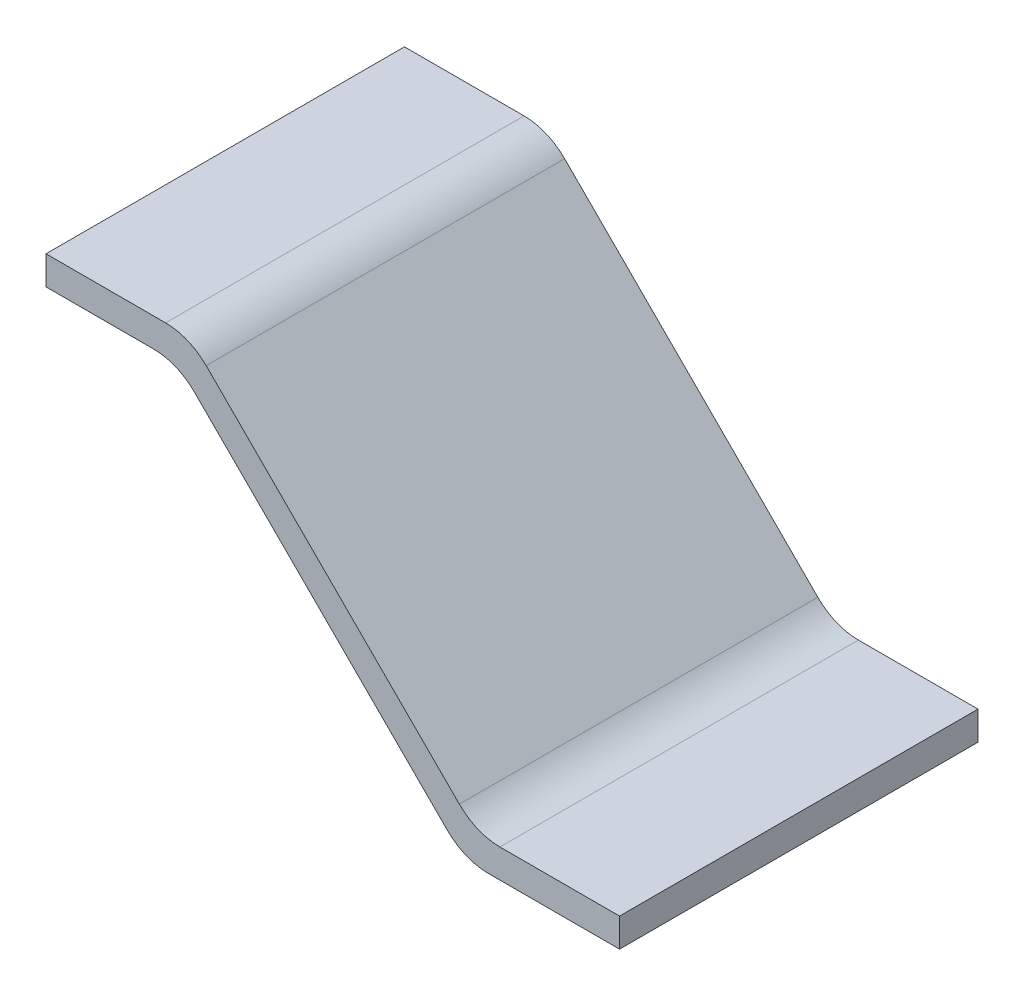
ISO-10303-21;
HEADER;
FILE_DESCRIPTION(('STEP AP214'),'2;1');
FILE_NAME('part.step','',(''),(''),'','','');
FILE_SCHEMA(('AUTOMOTIVE_DESIGN { 1 0 10303 214 1 1 1 1 }'));
ENDSEC;
DATA;
#1=APPLICATION_CONTEXT('core data for automotive mechanical design processes');
#2=APPLICATION_PROTOCOL_DEFINITION('international standard','automotive_design',2000,#1);
#3=PRODUCT_CONTEXT('',#1,'mechanical');
#4=PRODUCT('Part','Part','',(#3));
#5=PRODUCT_RELATED_PRODUCT_CATEGORY('part','',(#4));
#6=PRODUCT_DEFINITION_FORMATION('','',#4);
#7=PRODUCT_DEFINITION_CONTEXT('part definition',#1,'design');
#8=PRODUCT_DEFINITION('design','',#6,#7);
#9=PRODUCT_DEFINITION_SHAPE('','',#8);
#10=(LENGTH_UNIT() NAMED_UNIT(*) SI_UNIT(.MILLI.,.METRE.));
#11=(NAMED_UNIT(*) PLANE_ANGLE_UNIT() SI_UNIT($,.RADIAN.));
#12=(NAMED_UNIT(*) SI_UNIT($,.STERADIAN.) SOLID_ANGLE_UNIT());
#13=UNCERTAINTY_MEASURE_WITH_UNIT(LENGTH_MEASURE(1.E-05),#10,'distance_accuracy_value','');
#14=(GEOMETRIC_REPRESENTATION_CONTEXT(3) GLOBAL_UNCERTAINTY_ASSIGNED_CONTEXT((#13)) GLOBAL_UNIT_ASSIGNED_CONTEXT((#10,
#11,#12)) REPRESENTATION_CONTEXT('',''));
#15=CARTESIAN_POINT('',(0.,0.,0.));
#16=DIRECTION('',(0.,0.,1.));
#17=DIRECTION('',(1.,0.,0.));
#18=AXIS2_PLACEMENT_3D('',#15,#16,#17);
#19=CARTESIAN_POINT('',(0.,-0.1,0.625));
#20=DIRECTION('',(1.,0.,0.));
#21=DIRECTION('',(0.,0.,-1.));
#22=AXIS2_PLACEMENT_3D('',#19,#20,#21);
#23=PLANE('',#22);
#24=DIRECTION('',(0.,-1.,0.));
#25=VECTOR('',#24,1.);
#26=CARTESIAN_POINT('',(0.,-0.1,-0.625));
#27=LINE('',#26,#25);
#28=CARTESIAN_POINT('',(0.,0.,-0.625));
#29=VERTEX_POINT('',#28);
#30=CARTESIAN_POINT('',(0.,-0.1,-0.625));
#31=VERTEX_POINT('',#30);
#32=EDGE_CURVE('E145',#29,#31,#27,.T.);
#33=ORIENTED_EDGE('',*,*,#32,.T.);
#34=DIRECTION('',(0.,0.,-1.));
#35=VECTOR('',#34,1.);
#36=CARTESIAN_POINT('',(0.,-0.1,0.625));
#37=LINE('',#36,#35);
#38=CARTESIAN_POINT('',(0.,-0.1,0.625));
#39=VERTEX_POINT('',#38);
#40=EDGE_CURVE('E127',#39,#31,#37,.T.);
#41=ORIENTED_EDGE('',*,*,#40,.F.);
#42=DIRECTION('',(0.,-1.,0.));
#43=VECTOR('',#42,1.);
#44=CARTESIAN_POINT('',(0.,-0.1,0.625));
#45=LINE('',#44,#43);
#46=CARTESIAN_POINT('',(0.,0.,0.625));
#47=VERTEX_POINT('',#46);
#48=EDGE_CURVE('E133',#47,#39,#45,.T.);
#49=ORIENTED_EDGE('',*,*,#48,.F.);
#50=DIRECTION('',(0.,0.,-1.));
#51=VECTOR('',#50,1.);
#52=CARTESIAN_POINT('',(0.,0.,0.625));
#53=LINE('',#52,#51);
#54=EDGE_CURVE('E207',#47,#29,#53,.T.);
#55=ORIENTED_EDGE('',*,*,#54,.T.);
#56=EDGE_LOOP('',(#33,#41,#49,#55));
#57=FACE_BOUND('',#56,.T.);
#58=ADVANCED_FACE('F32',(#57),#23,.F.);
#59=CARTESIAN_POINT('',(0.,-0.1,0.625));
#60=DIRECTION('',(0.,1.,0.));
#61=DIRECTION('',(-1.,0.,0.));
#62=AXIS2_PLACEMENT_3D('',#59,#60,#61);
#63=PLANE('',#62);
#64=DIRECTION('',(1.,0.,0.));
#65=VECTOR('',#64,1.);
#66=CARTESIAN_POINT('',(0.,-0.1,-0.625));
#67=LINE('',#66,#65);
#68=CARTESIAN_POINT('',(0.375735931288085,-0.0999999999999995,-0.625));
#69=VERTEX_POINT('',#68);
#70=EDGE_CURVE('E214',#31,#69,#67,.T.);
#71=ORIENTED_EDGE('',*,*,#70,.T.);
#72=DIRECTION('',(0.,0.,-1.));
#73=VECTOR('',#72,1.);
#74=CARTESIAN_POINT('',(0.375735931288085,-0.0999999999999995,0.625));
#75=LINE('',#74,#73);
#76=CARTESIAN_POINT('',(0.375735931288085,-0.0999999999999995,0.625));
#77=VERTEX_POINT('',#76);
#78=EDGE_CURVE('E130',#69,#77,#75,.F.);
#79=ORIENTED_EDGE('',*,*,#78,.T.);
#80=DIRECTION('',(1.,0.,0.));
#81=VECTOR('',#80,1.);
#82=CARTESIAN_POINT('',(0.,-0.1,0.625));
#83=LINE('',#82,#81);
#84=EDGE_CURVE('E122',#39,#77,#83,.T.);
#85=ORIENTED_EDGE('',*,*,#84,.F.);
#86=ORIENTED_EDGE('',*,*,#40,.T.);
#87=EDGE_LOOP('',(#71,#79,#85,#86));
#88=FACE_BOUND('',#87,.T.);
#89=ADVANCED_FACE('F125',(#88),#63,.F.);
#90=CARTESIAN_POINT('',(0.458578643762704,-0.0999999999999994,0.625));
#91=DIRECTION('',(0.707106781186549,0.707106781186546,0.));
#92=DIRECTION('',(-0.707106781186546,0.707106781186549,0.));
#93=AXIS2_PLACEMENT_3D('',#90,#91,#92);
#94=PLANE('',#93);
#95=DIRECTION('',(0.707106781186546,-0.707106781186549,0.));
#96=VECTOR('',#95,1.);
#97=CARTESIAN_POINT('',(0.458578643762704,-0.0999999999999994,0.625));
#98=LINE('',#97,#96);
#99=CARTESIAN_POINT('',(0.517157287525395,-0.15857864376269,0.625));
#100=VERTEX_POINT('',#99);
#101=CARTESIAN_POINT('',(1.40000000000001,-1.04142135623731,0.625));
#102=VERTEX_POINT('',#101);
#103=EDGE_CURVE('E132',#100,#102,#98,.T.);
#104=ORIENTED_EDGE('',*,*,#103,.F.);
#105=DIRECTION('',(0.,0.,-1.));
#106=VECTOR('',#105,1.);
#107=CARTESIAN_POINT('',(0.517157287525395,-0.15857864376269,-0.625));
#108=LINE('',#107,#106);
#109=CARTESIAN_POINT('',(0.517157287525395,-0.15857864376269,-0.625));
#110=VERTEX_POINT('',#109);
#111=EDGE_CURVE('E149',#100,#110,#108,.T.);
#112=ORIENTED_EDGE('',*,*,#111,.T.);
#113=DIRECTION('',(0.707106781186546,-0.707106781186549,0.));
#114=VECTOR('',#113,1.);
#115=CARTESIAN_POINT('',(0.458578643762704,-0.0999999999999994,-0.625));
#116=LINE('',#115,#114);
#117=CARTESIAN_POINT('',(1.40000000000001,-1.04142135623731,-0.625));
#118=VERTEX_POINT('',#117);
#119=EDGE_CURVE('E216',#110,#118,#116,.T.);
#120=ORIENTED_EDGE('',*,*,#119,.T.);
#121=DIRECTION('',(0.,0.,-1.));
#122=VECTOR('',#121,1.);
#123=CARTESIAN_POINT('',(1.40000000000001,-1.04142135623731,0.625));
#124=LINE('',#123,#122);
#125=EDGE_CURVE('E146',#118,#102,#124,.F.);
#126=ORIENTED_EDGE('',*,*,#125,.T.);
#127=EDGE_LOOP('',(#104,#112,#120,#126));
#128=FACE_BOUND('',#127,.T.);
#129=ADVANCED_FACE('F233',(#128),#94,.F.);
#130=CARTESIAN_POINT('',(1.4585786437627,-1.1,0.625));
#131=DIRECTION('',(0.,1.,0.));
#132=DIRECTION('',(0.,0.,1.));
#133=AXIS2_PLACEMENT_3D('',#130,#131,#132);
#134=PLANE('',#133);
#135=DIRECTION('',(1.,0.,0.));
#136=VECTOR('',#135,1.);
#137=CARTESIAN_POINT('',(1.4585786437627,-1.1,0.625));
#138=LINE('',#137,#136);
#139=CARTESIAN_POINT('',(1.54142135623732,-1.1,0.625));
#140=VERTEX_POINT('',#139);
#141=CARTESIAN_POINT('',(2.,-1.1,0.625));
#142=VERTEX_POINT('',#141);
#143=EDGE_CURVE('E235',#140,#142,#138,.T.);
#144=ORIENTED_EDGE('',*,*,#143,.F.);
#145=DIRECTION('',(0.,0.,-1.));
#146=VECTOR('',#145,1.);
#147=CARTESIAN_POINT('',(1.54142135623732,-1.1,0.625));
#148=LINE('',#147,#146);
#149=CARTESIAN_POINT('',(1.54142135623732,-1.1,-0.625));
#150=VERTEX_POINT('',#149);
#151=EDGE_CURVE('E159',#140,#150,#148,.T.);
#152=ORIENTED_EDGE('',*,*,#151,.T.);
#153=DIRECTION('',(1.,0.,0.));
#154=VECTOR('',#153,1.);
#155=CARTESIAN_POINT('',(1.4585786437627,-1.1,-0.625));
#156=LINE('',#155,#154);
#157=CARTESIAN_POINT('',(2.,-1.1,-0.625));
#158=VERTEX_POINT('',#157);
#159=EDGE_CURVE('E219',#150,#158,#156,.T.);
#160=ORIENTED_EDGE('',*,*,#159,.T.);
#161=DIRECTION('',(0.,0.,-1.));
#162=VECTOR('',#161,1.);
#163=CARTESIAN_POINT('',(2.,-1.1,0.625));
#164=LINE('',#163,#162);
#165=EDGE_CURVE('E147',#142,#158,#164,.T.);
#166=ORIENTED_EDGE('',*,*,#165,.F.);
#167=EDGE_LOOP('',(#144,#152,#160,#166));
#168=FACE_BOUND('',#167,.T.);
#169=ADVANCED_FACE('F244',(#168),#134,.F.);
#170=CARTESIAN_POINT('',(2.,-1.1,0.625));
#171=DIRECTION('',(-1.,0.,0.));
#172=DIRECTION('',(0.,0.,1.));
#173=AXIS2_PLACEMENT_3D('',#170,#171,#172);
#174=PLANE('',#173);
#175=DIRECTION('',(0.,1.,0.));
#176=VECTOR('',#175,1.);
#177=CARTESIAN_POINT('',(2.,-1.1,-0.625));
#178=LINE('',#177,#176);
#179=CARTESIAN_POINT('',(2.,-1.,-0.625));
#180=VERTEX_POINT('',#179);
#181=EDGE_CURVE('E199',#158,#180,#178,.T.);
#182=ORIENTED_EDGE('',*,*,#181,.T.);
#183=DIRECTION('',(0.,0.,-1.));
#184=VECTOR('',#183,1.);
#185=CARTESIAN_POINT('',(2.,-1.,0.625));
#186=LINE('',#185,#184);
#187=CARTESIAN_POINT('',(2.,-1.,0.625));
#188=VERTEX_POINT('',#187);
#189=EDGE_CURVE('E152',#188,#180,#186,.T.);
#190=ORIENTED_EDGE('',*,*,#189,.F.);
#191=DIRECTION('',(0.,1.,0.));
#192=VECTOR('',#191,1.);
#193=CARTESIAN_POINT('',(2.,-1.1,0.625));
#194=LINE('',#193,#192);
#195=EDGE_CURVE('E209',#142,#188,#194,.T.);
#196=ORIENTED_EDGE('',*,*,#195,.F.);
#197=ORIENTED_EDGE('',*,*,#165,.T.);
#198=EDGE_LOOP('',(#182,#190,#196,#197));
#199=FACE_BOUND('',#198,.T.);
#200=ADVANCED_FACE('F242',(#199),#174,.F.);
#201=CARTESIAN_POINT('',(1.5,-1.,0.625));
#202=DIRECTION('',(0.,-1.,0.));
#203=DIRECTION('',(1.,0.,0.));
#204=AXIS2_PLACEMENT_3D('',#201,#202,#203);
#205=PLANE('',#204);
#206=DIRECTION('',(-1.,0.,0.));
#207=VECTOR('',#206,1.);
#208=CARTESIAN_POINT('',(1.5,-1.,-0.625));
#209=LINE('',#208,#207);
#210=CARTESIAN_POINT('',(1.58284271247462,-1.,-0.625));
#211=VERTEX_POINT('',#210);
#212=EDGE_CURVE('E188',#180,#211,#209,.T.);
#213=ORIENTED_EDGE('',*,*,#212,.T.);
#214=DIRECTION('',(0.,0.,-1.));
#215=VECTOR('',#214,1.);
#216=CARTESIAN_POINT('',(1.58284271247462,-1.,0.625));
#217=LINE('',#216,#215);
#218=CARTESIAN_POINT('',(1.58284271247462,-1.,0.625));
#219=VERTEX_POINT('',#218);
#220=EDGE_CURVE('E173',#211,#219,#217,.F.);
#221=ORIENTED_EDGE('',*,*,#220,.T.);
#222=DIRECTION('',(-1.,0.,0.));
#223=VECTOR('',#222,1.);
#224=CARTESIAN_POINT('',(1.5,-1.,0.625));
#225=LINE('',#224,#223);
#226=EDGE_CURVE('E204',#188,#219,#225,.T.);
#227=ORIENTED_EDGE('',*,*,#226,.F.);
#228=ORIENTED_EDGE('',*,*,#189,.T.);
#229=EDGE_LOOP('',(#213,#221,#227,#228));
#230=FACE_BOUND('',#229,.T.);
#231=ADVANCED_FACE('F195',(#230),#205,.F.);
#232=CARTESIAN_POINT('',(0.5,0.,0.625));
#233=DIRECTION('',(-0.707106781186547,-0.707106781186548,0.));
#234=DIRECTION('',(0.707106781186548,-0.707106781186547,0.));
#235=AXIS2_PLACEMENT_3D('',#232,#233,#234);
#236=PLANE('',#235);
#237=DIRECTION('',(-0.707106781186548,0.707106781186547,0.));
#238=VECTOR('',#237,1.);
#239=CARTESIAN_POINT('',(0.5,0.,0.625));
#240=LINE('',#239,#238);
#241=CARTESIAN_POINT('',(1.44142135623731,-0.94142135623731,0.625));
#242=VERTEX_POINT('',#241);
#243=CARTESIAN_POINT('',(0.558578643762691,-0.0585786437626904,0.625));
#244=VERTEX_POINT('',#243);
#245=EDGE_CURVE('E203',#242,#244,#240,.T.);
#246=ORIENTED_EDGE('',*,*,#245,.F.);
#247=DIRECTION('',(0.,0.,-1.));
#248=VECTOR('',#247,1.);
#249=CARTESIAN_POINT('',(1.44142135623731,-0.94142135623731,-0.625));
#250=LINE('',#249,#248);
#251=CARTESIAN_POINT('',(1.44142135623731,-0.94142135623731,-0.625));
#252=VERTEX_POINT('',#251);
#253=EDGE_CURVE('E170',#242,#252,#250,.T.);
#254=ORIENTED_EDGE('',*,*,#253,.T.);
#255=DIRECTION('',(-0.707106781186548,0.707106781186547,0.));
#256=VECTOR('',#255,1.);
#257=CARTESIAN_POINT('',(0.5,0.,-0.625));
#258=LINE('',#257,#256);
#259=CARTESIAN_POINT('',(0.558578643762691,-0.0585786437626904,-0.625));
#260=VERTEX_POINT('',#259);
#261=EDGE_CURVE('E189',#252,#260,#258,.T.);
#262=ORIENTED_EDGE('',*,*,#261,.T.);
#263=DIRECTION('',(0.,0.,-1.));
#264=VECTOR('',#263,1.);
#265=CARTESIAN_POINT('',(0.558578643762691,-0.0585786437626904,0.625));
#266=LINE('',#265,#264);
#267=EDGE_CURVE('E55',#260,#244,#266,.F.);
#268=ORIENTED_EDGE('',*,*,#267,.T.);
#269=EDGE_LOOP('',(#246,#254,#262,#268));
#270=FACE_BOUND('',#269,.T.);
#271=ADVANCED_FACE('F205',(#270),#236,.F.);
#272=CARTESIAN_POINT('',(0.,0.,0.625));
#273=DIRECTION('',(0.,-1.,0.));
#274=DIRECTION('',(0.,0.,-1.));
#275=AXIS2_PLACEMENT_3D('',#272,#273,#274);
#276=PLANE('',#275);
#277=DIRECTION('',(-1.,0.,0.));
#278=VECTOR('',#277,1.);
#279=CARTESIAN_POINT('',(0.,0.,0.625));
#280=LINE('',#279,#278);
#281=CARTESIAN_POINT('',(0.417157287525381,0.,0.625));
#282=VERTEX_POINT('',#281);
#283=EDGE_CURVE('E138',#282,#47,#280,.T.);
#284=ORIENTED_EDGE('',*,*,#283,.F.);
#285=DIRECTION('',(0.,0.,-1.));
#286=VECTOR('',#285,1.);
#287=CARTESIAN_POINT('',(0.417157287525381,0.,0.625));
#288=LINE('',#287,#286);
#289=CARTESIAN_POINT('',(0.417157287525381,0.,-0.625));
#290=VERTEX_POINT('',#289);
#291=EDGE_CURVE('E175',#282,#290,#288,.T.);
#292=ORIENTED_EDGE('',*,*,#291,.T.);
#293=DIRECTION('',(-1.,0.,0.));
#294=VECTOR('',#293,1.);
#295=CARTESIAN_POINT('',(0.,0.,-0.625));
#296=LINE('',#295,#294);
#297=EDGE_CURVE('E142',#290,#29,#296,.T.);
#298=ORIENTED_EDGE('',*,*,#297,.T.);
#299=ORIENTED_EDGE('',*,*,#54,.F.);
#300=EDGE_LOOP('',(#284,#292,#298,#299));
#301=FACE_BOUND('',#300,.T.);
#302=ADVANCED_FACE('F272',(#301),#276,.F.);
#303=CARTESIAN_POINT('',(0.,0.,0.625));
#304=DIRECTION('',(0.,0.,-1.));
#305=DIRECTION('',(-1.,0.,0.));
#306=AXIS2_PLACEMENT_3D('',#303,#304,#305);
#307=PLANE('',#306);
#308=ORIENTED_EDGE('',*,*,#103,.T.);
#309=CARTESIAN_POINT('',(1.54142135623732,-0.900000000000001,0.625));
#310=DIRECTION('',(0.,0.,-1.));
#311=DIRECTION('',(-1.,0.,0.));
#312=AXIS2_PLACEMENT_3D('',#309,#310,#311);
#313=CIRCLE('',#312,0.2);
#314=EDGE_CURVE('E167',#102,#140,#313,.F.);
#315=ORIENTED_EDGE('',*,*,#314,.T.);
#316=ORIENTED_EDGE('',*,*,#143,.T.);
#317=ORIENTED_EDGE('',*,*,#195,.T.);
#318=ORIENTED_EDGE('',*,*,#226,.T.);
#319=CARTESIAN_POINT('',(1.58284271247462,-0.8,0.625));
#320=DIRECTION('',(0.,0.,-1.));
#321=DIRECTION('',(-1.,0.,0.));
#322=AXIS2_PLACEMENT_3D('',#319,#320,#321);
#323=CIRCLE('',#322,0.2);
#324=EDGE_CURVE('E11',#219,#242,#323,.T.);
#325=ORIENTED_EDGE('',*,*,#324,.T.);
#326=ORIENTED_EDGE('',*,*,#245,.T.);
#327=CARTESIAN_POINT('',(0.417157287525381,-0.2,0.625));
#328=DIRECTION('',(0.,0.,-1.));
#329=DIRECTION('',(-1.,0.,0.));
#330=AXIS2_PLACEMENT_3D('',#327,#328,#329);
#331=CIRCLE('',#330,0.2);
#332=EDGE_CURVE('E47',#244,#282,#331,.F.);
#333=ORIENTED_EDGE('',*,*,#332,.T.);
#334=ORIENTED_EDGE('',*,*,#283,.T.);
#335=ORIENTED_EDGE('',*,*,#48,.T.);
#336=ORIENTED_EDGE('',*,*,#84,.T.);
#337=CARTESIAN_POINT('',(0.375735931288085,-0.3,0.625));
#338=DIRECTION('',(0.,0.,-1.));
#339=DIRECTION('',(-1.,0.,0.));
#340=AXIS2_PLACEMENT_3D('',#337,#338,#339);
#341=CIRCLE('',#340,0.2);
#342=EDGE_CURVE('E180',#77,#100,#341,.T.);
#343=ORIENTED_EDGE('',*,*,#342,.T.);
#344=EDGE_LOOP('',(#308,#315,#316,#317,#318,#325,#326,#333,#334,#335,#336,#343));
#345=FACE_BOUND('',#344,.T.);
#346=ADVANCED_FACE('F137',(#345),#307,.F.);
#347=CARTESIAN_POINT('',(0.,0.,-0.625));
#348=DIRECTION('',(0.,0.,-1.));
#349=DIRECTION('',(-1.,0.,0.));
#350=AXIS2_PLACEMENT_3D('',#347,#348,#349);
#351=PLANE('',#350);
#352=ORIENTED_EDGE('',*,*,#159,.F.);
#353=CARTESIAN_POINT('',(1.54142135623732,-0.900000000000001,-0.625));
#354=DIRECTION('',(0.,0.,-1.));
#355=DIRECTION('',(-1.,0.,0.));
#356=AXIS2_PLACEMENT_3D('',#353,#354,#355);
#357=CIRCLE('',#356,0.2);
#358=EDGE_CURVE('E164',#150,#118,#357,.T.);
#359=ORIENTED_EDGE('',*,*,#358,.T.);
#360=ORIENTED_EDGE('',*,*,#119,.F.);
#361=CARTESIAN_POINT('',(0.375735931288085,-0.3,-0.625));
#362=DIRECTION('',(0.,0.,-1.));
#363=DIRECTION('',(-1.,0.,0.));
#364=AXIS2_PLACEMENT_3D('',#361,#362,#363);
#365=CIRCLE('',#364,0.2);
#366=EDGE_CURVE('E178',#110,#69,#365,.F.);
#367=ORIENTED_EDGE('',*,*,#366,.T.);
#368=ORIENTED_EDGE('',*,*,#70,.F.);
#369=ORIENTED_EDGE('',*,*,#32,.F.);
#370=ORIENTED_EDGE('',*,*,#297,.F.);
#371=CARTESIAN_POINT('',(0.417157287525381,-0.2,-0.625));
#372=DIRECTION('',(0.,0.,-1.));
#373=DIRECTION('',(-1.,0.,0.));
#374=AXIS2_PLACEMENT_3D('',#371,#372,#373);
#375=CIRCLE('',#374,0.2);
#376=EDGE_CURVE('E162',#290,#260,#375,.T.);
#377=ORIENTED_EDGE('',*,*,#376,.T.);
#378=ORIENTED_EDGE('',*,*,#261,.F.);
#379=CARTESIAN_POINT('',(1.58284271247462,-0.8,-0.625));
#380=DIRECTION('',(0.,0.,-1.));
#381=DIRECTION('',(-1.,0.,0.));
#382=AXIS2_PLACEMENT_3D('',#379,#380,#381);
#383=CIRCLE('',#382,0.2);
#384=EDGE_CURVE('E40',#252,#211,#383,.F.);
#385=ORIENTED_EDGE('',*,*,#384,.T.);
#386=ORIENTED_EDGE('',*,*,#212,.F.);
#387=ORIENTED_EDGE('',*,*,#181,.F.);
#388=EDGE_LOOP('',(#352,#359,#360,#367,#368,#369,#370,#377,#378,#385,#386,#387));
#389=FACE_BOUND('',#388,.T.);
#390=ADVANCED_FACE('F186',(#389),#351,.T.);
#391=CARTESIAN_POINT('',(0.375735931288085,-0.3,0.625));
#392=DIRECTION('',(0.,0.,1.));
#393=DIRECTION('',(1.,0.,0.));
#394=AXIS2_PLACEMENT_3D('',#391,#392,#393);
#395=CYLINDRICAL_SURFACE('',#394,0.2);
#396=ORIENTED_EDGE('',*,*,#342,.F.);
#397=ORIENTED_EDGE('',*,*,#78,.F.);
#398=ORIENTED_EDGE('',*,*,#366,.F.);
#399=ORIENTED_EDGE('',*,*,#111,.F.);
#400=EDGE_LOOP('',(#396,#397,#398,#399));
#401=FACE_BOUND('',#400,.T.);
#402=ADVANCED_FACE('F228',(#401),#395,.F.);
#403=CARTESIAN_POINT('',(1.54142135623732,-0.900000000000001,0.625));
#404=DIRECTION('',(0.,0.,-1.));
#405=DIRECTION('',(-1.,0.,0.));
#406=AXIS2_PLACEMENT_3D('',#403,#404,#405);
#407=CYLINDRICAL_SURFACE('',#406,0.2);
#408=ORIENTED_EDGE('',*,*,#314,.F.);
#409=ORIENTED_EDGE('',*,*,#125,.F.);
#410=ORIENTED_EDGE('',*,*,#358,.F.);
#411=ORIENTED_EDGE('',*,*,#151,.F.);
#412=EDGE_LOOP('',(#408,#409,#410,#411));
#413=FACE_BOUND('',#412,.T.);
#414=ADVANCED_FACE('F247',(#413),#407,.T.);
#415=CARTESIAN_POINT('',(1.58284271247462,-0.8,0.625));
#416=DIRECTION('',(0.,0.,1.));
#417=DIRECTION('',(1.,0.,0.));
#418=AXIS2_PLACEMENT_3D('',#415,#416,#417);
#419=CYLINDRICAL_SURFACE('',#418,0.2);
#420=ORIENTED_EDGE('',*,*,#324,.F.);
#421=ORIENTED_EDGE('',*,*,#220,.F.);
#422=ORIENTED_EDGE('',*,*,#384,.F.);
#423=ORIENTED_EDGE('',*,*,#253,.F.);
#424=EDGE_LOOP('',(#420,#421,#422,#423));
#425=FACE_BOUND('',#424,.T.);
#426=ADVANCED_FACE('F202',(#425),#419,.F.);
#427=CARTESIAN_POINT('',(0.417157287525381,-0.2,0.625));
#428=DIRECTION('',(0.,0.,-1.));
#429=DIRECTION('',(-1.,0.,0.));
#430=AXIS2_PLACEMENT_3D('',#427,#428,#429);
#431=CYLINDRICAL_SURFACE('',#430,0.2);
#432=ORIENTED_EDGE('',*,*,#332,.F.);
#433=ORIENTED_EDGE('',*,*,#267,.F.);
#434=ORIENTED_EDGE('',*,*,#376,.F.);
#435=ORIENTED_EDGE('',*,*,#291,.F.);
#436=EDGE_LOOP('',(#432,#433,#434,#435));
#437=FACE_BOUND('',#436,.T.);
#438=ADVANCED_FACE('F34',(#437),#431,.T.);
#439=CLOSED_SHELL('',(#58,#89,#129,#169,#200,#231,#271,#302,#346,#390,#402,#414,#426,#438));
#440=MANIFOLD_SOLID_BREP('B2',#439);
#441=ADVANCED_BREP_SHAPE_REPRESENTATION('',(#18,#440),#14);
#442=SHAPE_DEFINITION_REPRESENTATION(#9,#441);
ENDSEC;
END-ISO-10303-21;
